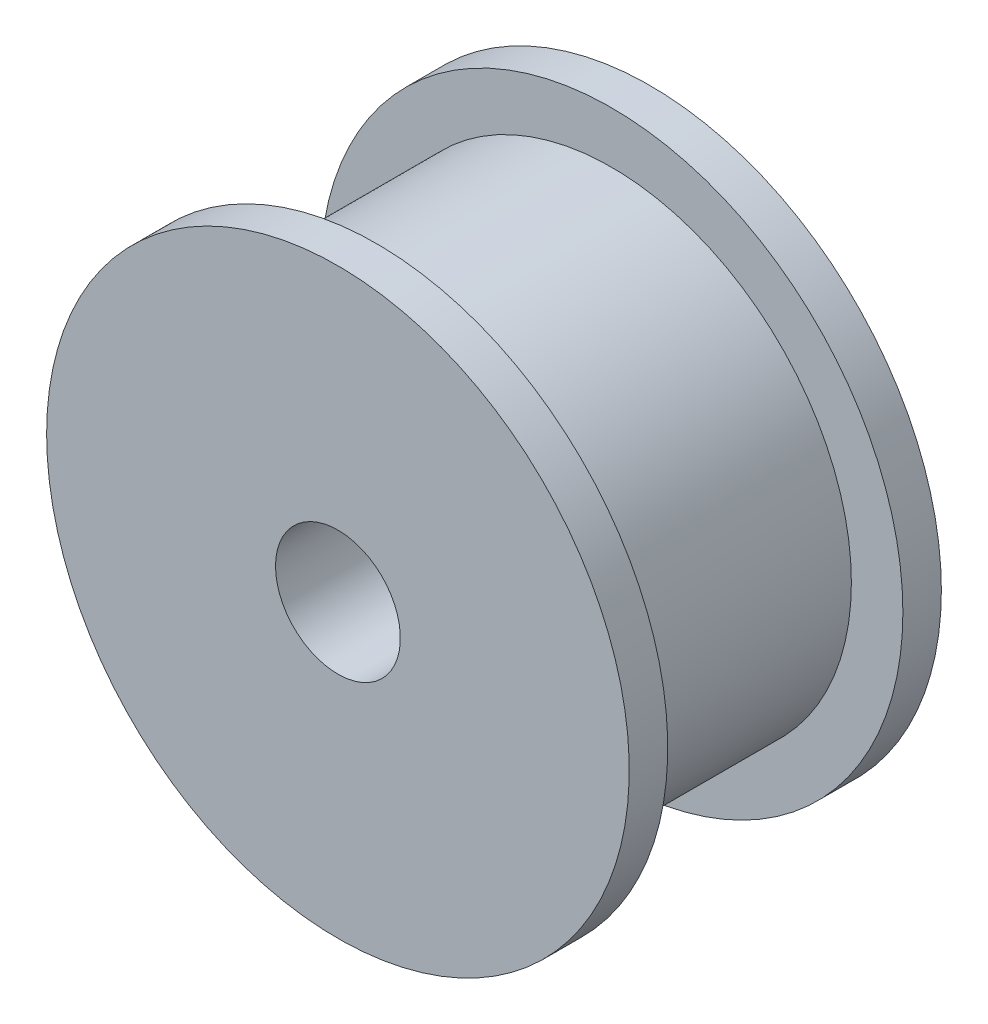
ISO-10303-21;
HEADER;
FILE_DESCRIPTION(('STEP AP214'),'2;1');
FILE_NAME('part.step','',(''),(''),'','','');
FILE_SCHEMA(('AUTOMOTIVE_DESIGN { 1 0 10303 214 1 1 1 1 }'));
ENDSEC;
DATA;
#1=APPLICATION_CONTEXT('core data for automotive mechanical design processes');
#2=APPLICATION_PROTOCOL_DEFINITION('international standard','automotive_design',2000,#1);
#3=PRODUCT_CONTEXT('',#1,'mechanical');
#4=PRODUCT('Part','Part','',(#3));
#5=PRODUCT_RELATED_PRODUCT_CATEGORY('part','',(#4));
#6=PRODUCT_DEFINITION_FORMATION('','',#4);
#7=PRODUCT_DEFINITION_CONTEXT('part definition',#1,'design');
#8=PRODUCT_DEFINITION('design','',#6,#7);
#9=PRODUCT_DEFINITION_SHAPE('','',#8);
#10=(LENGTH_UNIT() NAMED_UNIT(*) SI_UNIT(.MILLI.,.METRE.));
#11=(NAMED_UNIT(*) PLANE_ANGLE_UNIT() SI_UNIT($,.RADIAN.));
#12=(NAMED_UNIT(*) SI_UNIT($,.STERADIAN.) SOLID_ANGLE_UNIT());
#13=UNCERTAINTY_MEASURE_WITH_UNIT(LENGTH_MEASURE(1.E-05),#10,'distance_accuracy_value','');
#14=(GEOMETRIC_REPRESENTATION_CONTEXT(3) GLOBAL_UNCERTAINTY_ASSIGNED_CONTEXT((#13)) GLOBAL_UNIT_ASSIGNED_CONTEXT((#10,
#11,#12)) REPRESENTATION_CONTEXT('',''));
#15=CARTESIAN_POINT('',(0.,0.,0.));
#16=DIRECTION('',(0.,0.,1.));
#17=DIRECTION('',(1.,0.,0.));
#18=AXIS2_PLACEMENT_3D('',#15,#16,#17);
#19=CARTESIAN_POINT('',(0.,14.81019722829,-11.27));
#20=DIRECTION('',(0.,0.,1.));
#21=DIRECTION('',(1.,0.,0.));
#22=AXIS2_PLACEMENT_3D('',#19,#20,#21);
#23=PLANE('',#22);
#24=CARTESIAN_POINT('',(-8.,0.,-11.27));
#25=DIRECTION('',(0.,0.,-1.));
#26=DIRECTION('',(-1.,0.,0.));
#27=AXIS2_PLACEMENT_3D('',#24,#25,#26);
#28=CIRCLE('',#27,1.24999999999999);
#29=CARTESIAN_POINT('',(-9.24999999999999,0.,-11.27));
#30=VERTEX_POINT('',#29);
#31=EDGE_CURVE('E87',#30,#30,#28,.T.);
#32=ORIENTED_EDGE('',*,*,#31,.F.);
#33=EDGE_LOOP('',(#32));
#34=FACE_BOUND('',#33,.T.);
#35=CARTESIAN_POINT('',(0.,-8.,-11.27));
#36=DIRECTION('',(0.,0.,-1.));
#37=DIRECTION('',(-1.,0.,0.));
#38=AXIS2_PLACEMENT_3D('',#35,#36,#37);
#39=CIRCLE('',#38,1.24999999999999);
#40=CARTESIAN_POINT('',(-1.24999999999999,-8.,-11.27));
#41=VERTEX_POINT('',#40);
#42=EDGE_CURVE('E105',#41,#41,#39,.T.);
#43=ORIENTED_EDGE('',*,*,#42,.F.);
#44=EDGE_LOOP('',(#43));
#45=FACE_BOUND('',#44,.T.);
#46=CARTESIAN_POINT('',(8.,0.,-11.27));
#47=DIRECTION('',(0.,0.,-1.));
#48=DIRECTION('',(-1.,0.,0.));
#49=AXIS2_PLACEMENT_3D('',#46,#47,#48);
#50=CIRCLE('',#49,1.24999999999999);
#51=CARTESIAN_POINT('',(6.75000000000001,0.,-11.27));
#52=VERTEX_POINT('',#51);
#53=EDGE_CURVE('E99',#52,#52,#50,.T.);
#54=ORIENTED_EDGE('',*,*,#53,.F.);
#55=EDGE_LOOP('',(#54));
#56=FACE_BOUND('',#55,.T.);
#57=CARTESIAN_POINT('',(0.,8.,-11.27));
#58=DIRECTION('',(0.,0.,-1.));
#59=DIRECTION('',(-1.,0.,0.));
#60=AXIS2_PLACEMENT_3D('',#57,#58,#59);
#61=CIRCLE('',#60,1.24999999999999);
#62=CARTESIAN_POINT('',(-1.24999999999996,8.,-11.27));
#63=VERTEX_POINT('',#62);
#64=EDGE_CURVE('E86',#63,#63,#61,.T.);
#65=ORIENTED_EDGE('',*,*,#64,.F.);
#66=EDGE_LOOP('',(#65));
#67=FACE_BOUND('',#66,.T.);
#68=CARTESIAN_POINT('',(0.,0.,-11.27));
#69=DIRECTION('',(0.,0.,1.));
#70=DIRECTION('',(1.,0.,0.));
#71=AXIS2_PLACEMENT_3D('',#68,#69,#70);
#72=CIRCLE('',#71,5.35000000000001);
#73=CARTESIAN_POINT('',(5.35000000000001,0.,-11.27));
#74=VERTEX_POINT('',#73);
#75=EDGE_CURVE('E117',#74,#74,#72,.T.);
#76=ORIENTED_EDGE('',*,*,#75,.T.);
#77=EDGE_LOOP('',(#76));
#78=FACE_BOUND('',#77,.T.);
#79=CARTESIAN_POINT('',(0.,0.,-11.27));
#80=DIRECTION('',(0.,0.,1.));
#81=DIRECTION('',(1.,0.,0.));
#82=AXIS2_PLACEMENT_3D('',#79,#80,#81);
#83=CIRCLE('',#82,14.);
#84=CARTESIAN_POINT('',(14.,0.,-11.27));
#85=VERTEX_POINT('',#84);
#86=EDGE_CURVE('E199',#85,#85,#83,.T.);
#87=ORIENTED_EDGE('',*,*,#86,.F.);
#88=EDGE_LOOP('',(#87));
#89=FACE_BOUND('',#88,.T.);
#90=ADVANCED_FACE('F54',(#34,#45,#56,#67,#78,#89),#23,.F.);
#91=CARTESIAN_POINT('',(0.,14.81019722829,3.73));
#92=DIRECTION('',(0.,0.,-1.));
#93=DIRECTION('',(-1.,0.,0.));
#94=AXIS2_PLACEMENT_3D('',#91,#92,#93);
#95=PLANE('',#94);
#96=CARTESIAN_POINT('',(0.,0.,3.73));
#97=DIRECTION('',(0.,0.,-1.));
#98=DIRECTION('',(-1.,0.,0.));
#99=AXIS2_PLACEMENT_3D('',#96,#97,#98);
#100=CIRCLE('',#99,3.);
#101=CARTESIAN_POINT('',(-3.,0.,3.73));
#102=VERTEX_POINT('',#101);
#103=EDGE_CURVE('E201',#102,#102,#100,.F.);
#104=ORIENTED_EDGE('',*,*,#103,.F.);
#105=EDGE_LOOP('',(#104));
#106=FACE_BOUND('',#105,.T.);
#107=CARTESIAN_POINT('',(0.,0.,3.73));
#108=DIRECTION('',(0.,0.,-1.));
#109=DIRECTION('',(-1.,0.,0.));
#110=AXIS2_PLACEMENT_3D('',#107,#108,#109);
#111=CIRCLE('',#110,14.);
#112=CARTESIAN_POINT('',(-14.,0.,3.73));
#113=VERTEX_POINT('',#112);
#114=EDGE_CURVE('E202',#113,#113,#111,.T.);
#115=ORIENTED_EDGE('',*,*,#114,.F.);
#116=EDGE_LOOP('',(#115));
#117=FACE_BOUND('',#116,.T.);
#118=ADVANCED_FACE('F141',(#106,#117),#95,.F.);
#119=CARTESIAN_POINT('',(0.,0.,-11.2700000000059));
#120=DIRECTION('',(0.,0.,1.));
#121=DIRECTION('',(1.,0.,0.));
#122=AXIS2_PLACEMENT_3D('',#119,#120,#121);
#123=CYLINDRICAL_SURFACE('',#122,3.);
#124=ORIENTED_EDGE('',*,*,#103,.T.);
#125=EDGE_LOOP('',(#124));
#126=FACE_BOUND('',#125,.T.);
#127=CARTESIAN_POINT('',(0.,0.,-9.27));
#128=DIRECTION('',(0.,0.,-1.));
#129=DIRECTION('',(-1.,0.,0.));
#130=AXIS2_PLACEMENT_3D('',#127,#128,#129);
#131=CIRCLE('',#130,3.);
#132=CARTESIAN_POINT('',(-3.,0.,-9.27));
#133=VERTEX_POINT('',#132);
#134=EDGE_CURVE('E93',#133,#133,#131,.F.);
#135=ORIENTED_EDGE('',*,*,#134,.F.);
#136=EDGE_LOOP('',(#135));
#137=FACE_BOUND('',#136,.T.);
#138=ADVANCED_FACE('F147',(#126,#137),#123,.F.);
#139=CARTESIAN_POINT('',(0.,-8.,-2.77000000000001));
#140=DIRECTION('',(0.,0.,-1.));
#141=DIRECTION('',(-1.,0.,0.));
#142=AXIS2_PLACEMENT_3D('',#139,#140,#141);
#143=CONICAL_SURFACE('',#142,1.24999999999999,1.02974425867665);
#144=CARTESIAN_POINT('',(0.,-8.,-2.01892422621556));
#145=VERTEX_POINT('',#144);
#146=VERTEX_LOOP('',#145);
#147=FACE_BOUND('',#146,.T.);
#148=CARTESIAN_POINT('',(0.,-8.,-2.77000000000001));
#149=DIRECTION('',(0.,0.,-1.));
#150=DIRECTION('',(-1.,0.,0.));
#151=AXIS2_PLACEMENT_3D('',#148,#149,#150);
#152=CIRCLE('',#151,1.24999999999999);
#153=CARTESIAN_POINT('',(-1.24999999999999,-8.,-2.77000000000001));
#154=VERTEX_POINT('',#153);
#155=EDGE_CURVE('E108',#154,#154,#152,.T.);
#156=ORIENTED_EDGE('',*,*,#155,.T.);
#157=EDGE_LOOP('',(#156));
#158=FACE_BOUND('',#157,.T.);
#159=ADVANCED_FACE('F154',(#147,#158),#143,.F.);
#160=CARTESIAN_POINT('',(0.,-8.,-11.27));
#161=DIRECTION('',(0.,0.,-1.));
#162=DIRECTION('',(-1.,0.,0.));
#163=AXIS2_PLACEMENT_3D('',#160,#161,#162);
#164=CYLINDRICAL_SURFACE('',#163,1.24999999999999);
#165=ORIENTED_EDGE('',*,*,#155,.F.);
#166=EDGE_LOOP('',(#165));
#167=FACE_BOUND('',#166,.T.);
#168=ORIENTED_EDGE('',*,*,#42,.T.);
#169=EDGE_LOOP('',(#168));
#170=FACE_BOUND('',#169,.T.);
#171=ADVANCED_FACE('F158',(#167,#170),#164,.F.);
#172=CARTESIAN_POINT('',(8.,0.,-2.77000000000001));
#173=DIRECTION('',(0.,0.,-1.));
#174=DIRECTION('',(-1.,0.,0.));
#175=AXIS2_PLACEMENT_3D('',#172,#173,#174);
#176=CONICAL_SURFACE('',#175,1.24999999999999,1.02974425867665);
#177=CARTESIAN_POINT('',(8.,0.,-2.01892422621556));
#178=VERTEX_POINT('',#177);
#179=VERTEX_LOOP('',#178);
#180=FACE_BOUND('',#179,.T.);
#181=CARTESIAN_POINT('',(8.,0.,-2.77000000000001));
#182=DIRECTION('',(0.,0.,-1.));
#183=DIRECTION('',(-1.,0.,0.));
#184=AXIS2_PLACEMENT_3D('',#181,#182,#183);
#185=CIRCLE('',#184,1.24999999999999);
#186=CARTESIAN_POINT('',(6.75000000000001,0.,-2.77000000000001));
#187=VERTEX_POINT('',#186);
#188=EDGE_CURVE('E102',#187,#187,#185,.T.);
#189=ORIENTED_EDGE('',*,*,#188,.T.);
#190=EDGE_LOOP('',(#189));
#191=FACE_BOUND('',#190,.T.);
#192=ADVANCED_FACE('F161',(#180,#191),#176,.F.);
#193=CARTESIAN_POINT('',(8.,0.,-11.27));
#194=DIRECTION('',(0.,0.,-1.));
#195=DIRECTION('',(-1.,0.,0.));
#196=AXIS2_PLACEMENT_3D('',#193,#194,#195);
#197=CYLINDRICAL_SURFACE('',#196,1.24999999999999);
#198=ORIENTED_EDGE('',*,*,#188,.F.);
#199=EDGE_LOOP('',(#198));
#200=FACE_BOUND('',#199,.T.);
#201=ORIENTED_EDGE('',*,*,#53,.T.);
#202=EDGE_LOOP('',(#201));
#203=FACE_BOUND('',#202,.T.);
#204=ADVANCED_FACE('F165',(#200,#203),#197,.F.);
#205=CARTESIAN_POINT('',(0.,8.,-2.77000000000001));
#206=DIRECTION('',(0.,0.,-1.));
#207=DIRECTION('',(-1.,0.,0.));
#208=AXIS2_PLACEMENT_3D('',#205,#206,#207);
#209=CONICAL_SURFACE('',#208,1.24999999999999,1.02974425867665);
#210=CARTESIAN_POINT('',(0.,8.,-2.01892422621556));
#211=VERTEX_POINT('',#210);
#212=VERTEX_LOOP('',#211);
#213=FACE_BOUND('',#212,.T.);
#214=CARTESIAN_POINT('',(0.,8.,-2.77000000000001));
#215=DIRECTION('',(0.,0.,-1.));
#216=DIRECTION('',(-1.,0.,0.));
#217=AXIS2_PLACEMENT_3D('',#214,#215,#216);
#218=CIRCLE('',#217,1.24999999999999);
#219=CARTESIAN_POINT('',(-1.24999999999996,8.,-2.77000000000001));
#220=VERTEX_POINT('',#219);
#221=EDGE_CURVE('E90',#220,#220,#218,.T.);
#222=ORIENTED_EDGE('',*,*,#221,.T.);
#223=EDGE_LOOP('',(#222));
#224=FACE_BOUND('',#223,.T.);
#225=ADVANCED_FACE('F168',(#213,#224),#209,.F.);
#226=CARTESIAN_POINT('',(0.,8.,-11.27));
#227=DIRECTION('',(0.,0.,-1.));
#228=DIRECTION('',(-1.,0.,0.));
#229=AXIS2_PLACEMENT_3D('',#226,#227,#228);
#230=CYLINDRICAL_SURFACE('',#229,1.24999999999999);
#231=ORIENTED_EDGE('',*,*,#221,.F.);
#232=EDGE_LOOP('',(#231));
#233=FACE_BOUND('',#232,.T.);
#234=ORIENTED_EDGE('',*,*,#64,.T.);
#235=EDGE_LOOP('',(#234));
#236=FACE_BOUND('',#235,.T.);
#237=ADVANCED_FACE('F80',(#233,#236),#230,.F.);
#238=CARTESIAN_POINT('',(-8.,0.,-2.77000000000001));
#239=DIRECTION('',(0.,0.,-1.));
#240=DIRECTION('',(-1.,0.,0.));
#241=AXIS2_PLACEMENT_3D('',#238,#239,#240);
#242=CONICAL_SURFACE('',#241,1.24999999999999,1.02974425867665);
#243=CARTESIAN_POINT('',(-8.,0.,-2.01892422621556));
#244=VERTEX_POINT('',#243);
#245=VERTEX_LOOP('',#244);
#246=FACE_BOUND('',#245,.T.);
#247=CARTESIAN_POINT('',(-8.,0.,-2.77000000000001));
#248=DIRECTION('',(0.,0.,-1.));
#249=DIRECTION('',(-1.,0.,0.));
#250=AXIS2_PLACEMENT_3D('',#247,#248,#249);
#251=CIRCLE('',#250,1.24999999999999);
#252=CARTESIAN_POINT('',(-9.24999999999999,0.,-2.77000000000001));
#253=VERTEX_POINT('',#252);
#254=EDGE_CURVE('E84',#253,#253,#251,.T.);
#255=ORIENTED_EDGE('',*,*,#254,.T.);
#256=EDGE_LOOP('',(#255));
#257=FACE_BOUND('',#256,.T.);
#258=ADVANCED_FACE('F76',(#246,#257),#242,.F.);
#259=CARTESIAN_POINT('',(-8.,0.,-11.27));
#260=DIRECTION('',(0.,0.,-1.));
#261=DIRECTION('',(-1.,0.,0.));
#262=AXIS2_PLACEMENT_3D('',#259,#260,#261);
#263=CYLINDRICAL_SURFACE('',#262,1.24999999999999);
#264=ORIENTED_EDGE('',*,*,#254,.F.);
#265=EDGE_LOOP('',(#264));
#266=FACE_BOUND('',#265,.T.);
#267=ORIENTED_EDGE('',*,*,#31,.T.);
#268=EDGE_LOOP('',(#267));
#269=FACE_BOUND('',#268,.T.);
#270=ADVANCED_FACE('F79',(#266,#269),#263,.F.);
#271=CARTESIAN_POINT('',(0.,0.,-9.27));
#272=DIRECTION('',(0.,0.,-1.));
#273=DIRECTION('',(-1.,0.,0.));
#274=AXIS2_PLACEMENT_3D('',#271,#272,#273);
#275=PLANE('',#274);
#276=CARTESIAN_POINT('',(0.,0.,-9.27));
#277=DIRECTION('',(0.,0.,-1.));
#278=DIRECTION('',(-1.,0.,0.));
#279=AXIS2_PLACEMENT_3D('',#276,#277,#278);
#280=CIRCLE('',#279,5.05);
#281=CARTESIAN_POINT('',(-5.05,0.,-9.27));
#282=VERTEX_POINT('',#281);
#283=EDGE_CURVE('E114',#282,#282,#280,.T.);
#284=ORIENTED_EDGE('',*,*,#283,.T.);
#285=EDGE_LOOP('',(#284));
#286=FACE_BOUND('',#285,.T.);
#287=ORIENTED_EDGE('',*,*,#134,.T.);
#288=EDGE_LOOP('',(#287));
#289=FACE_BOUND('',#288,.T.);
#290=ADVANCED_FACE('F178',(#286,#289),#275,.T.);
#291=CARTESIAN_POINT('',(0.,0.,-9.27));
#292=DIRECTION('',(0.,0.,-1.));
#293=DIRECTION('',(-1.,0.,0.));
#294=AXIS2_PLACEMENT_3D('',#291,#292,#293);
#295=CYLINDRICAL_SURFACE('',#294,5.05);
#296=CARTESIAN_POINT('',(0.,0.,-10.97));
#297=DIRECTION('',(0.,0.,1.));
#298=DIRECTION('',(1.,0.,0.));
#299=AXIS2_PLACEMENT_3D('',#296,#297,#298);
#300=CIRCLE('',#299,5.05);
#301=CARTESIAN_POINT('',(5.05,0.,-10.97));
#302=VERTEX_POINT('',#301);
#303=EDGE_CURVE('E111',#302,#302,#300,.F.);
#304=ORIENTED_EDGE('',*,*,#303,.T.);
#305=EDGE_LOOP('',(#304));
#306=FACE_BOUND('',#305,.T.);
#307=ORIENTED_EDGE('',*,*,#283,.F.);
#308=EDGE_LOOP('',(#307));
#309=FACE_BOUND('',#308,.T.);
#310=ADVANCED_FACE('F179',(#306,#309),#295,.F.);
#311=CARTESIAN_POINT('',(0.,0.,-10.97));
#312=DIRECTION('',(0.,0.,-1.));
#313=DIRECTION('',(-1.,0.,0.));
#314=AXIS2_PLACEMENT_3D('',#311,#312,#313);
#315=CONICAL_SURFACE('',#314,5.05,0.785398163397435);
#316=ORIENTED_EDGE('',*,*,#75,.F.);
#317=EDGE_LOOP('',(#316));
#318=FACE_BOUND('',#317,.T.);
#319=ORIENTED_EDGE('',*,*,#303,.F.);
#320=EDGE_LOOP('',(#319));
#321=FACE_BOUND('',#320,.T.);
#322=ADVANCED_FACE('F56',(#318,#321),#315,.F.);
#323=CARTESIAN_POINT('',(0.,0.,-11.5202377215361));
#324=DIRECTION('',(0.,0.,1.));
#325=DIRECTION('',(1.,0.,0.));
#326=AXIS2_PLACEMENT_3D('',#323,#324,#325);
#327=CYLINDRICAL_SURFACE('',#326,14.);
#328=CARTESIAN_POINT('',(0.,0.,1.87999999999933));
#329=DIRECTION('',(0.,0.,-1.));
#330=DIRECTION('',(-1.,0.,0.));
#331=AXIS2_PLACEMENT_3D('',#328,#329,#330);
#332=CIRCLE('',#331,14.);
#333=CARTESIAN_POINT('',(-14.,0.,1.87999999999933));
#334=VERTEX_POINT('',#333);
#335=EDGE_CURVE('E58',#334,#334,#332,.T.);
#336=ORIENTED_EDGE('',*,*,#335,.F.);
#337=EDGE_LOOP('',(#336));
#338=FACE_BOUND('',#337,.T.);
#339=ORIENTED_EDGE('',*,*,#114,.T.);
#340=EDGE_LOOP('',(#339));
#341=FACE_BOUND('',#340,.T.);
#342=ADVANCED_FACE('F187',(#338,#341),#327,.T.);
#343=CARTESIAN_POINT('',(0.,0.,-9.42000000000067));
#344=DIRECTION('',(0.,0.,1.));
#345=DIRECTION('',(1.,0.,0.));
#346=AXIS2_PLACEMENT_3D('',#343,#344,#345);
#347=CIRCLE('',#346,14.);
#348=CARTESIAN_POINT('',(14.,0.,-9.42000000000067));
#349=VERTEX_POINT('',#348);
#350=EDGE_CURVE('E196',#349,#349,#347,.T.);
#351=ORIENTED_EDGE('',*,*,#350,.F.);
#352=EDGE_LOOP('',(#351));
#353=FACE_BOUND('',#352,.T.);
#354=ORIENTED_EDGE('',*,*,#86,.T.);
#355=EDGE_LOOP('',(#354));
#356=FACE_BOUND('',#355,.T.);
#357=ADVANCED_FACE('F136',(#353,#356),#327,.T.);
#358=CARTESIAN_POINT('',(-14.8499999999988,0.,-9.42000000000067));
#359=DIRECTION('',(0.,0.,1.));
#360=DIRECTION('',(1.,0.,0.));
#361=AXIS2_PLACEMENT_3D('',#358,#359,#360);
#362=PLANE('',#361);
#363=CARTESIAN_POINT('',(0.,0.,-9.42000000000067));
#364=DIRECTION('',(0.,0.,1.));
#365=DIRECTION('',(1.,0.,0.));
#366=AXIS2_PLACEMENT_3D('',#363,#364,#365);
#367=CIRCLE('',#366,11.525);
#368=CARTESIAN_POINT('',(11.525,0.,-9.42000000000067));
#369=VERTEX_POINT('',#368);
#370=EDGE_CURVE('E63',#369,#369,#367,.F.);
#371=ORIENTED_EDGE('',*,*,#370,.T.);
#372=EDGE_LOOP('',(#371));
#373=FACE_BOUND('',#372,.T.);
#374=ORIENTED_EDGE('',*,*,#350,.T.);
#375=EDGE_LOOP('',(#374));
#376=FACE_BOUND('',#375,.T.);
#377=ADVANCED_FACE('F123',(#373,#376),#362,.T.);
#378=CARTESIAN_POINT('',(0.,0.,0.));
#379=DIRECTION('',(0.,0.,1.));
#380=DIRECTION('',(1.,0.,0.));
#381=AXIS2_PLACEMENT_3D('',#378,#379,#380);
#382=CYLINDRICAL_SURFACE('',#381,11.525);
#383=CARTESIAN_POINT('',(0.,0.,1.87999999999933));
#384=DIRECTION('',(0.,0.,-1.));
#385=DIRECTION('',(-1.,0.,0.));
#386=AXIS2_PLACEMENT_3D('',#383,#384,#385);
#387=CIRCLE('',#386,11.525);
#388=CARTESIAN_POINT('',(-11.525,0.,1.87999999999933));
#389=VERTEX_POINT('',#388);
#390=EDGE_CURVE('E13',#389,#389,#387,.F.);
#391=ORIENTED_EDGE('',*,*,#390,.F.);
#392=EDGE_LOOP('',(#391));
#393=FACE_BOUND('',#392,.T.);
#394=ORIENTED_EDGE('',*,*,#370,.F.);
#395=EDGE_LOOP('',(#394));
#396=FACE_BOUND('',#395,.T.);
#397=ADVANCED_FACE('F126',(#393,#396),#382,.T.);
#398=CARTESIAN_POINT('',(-14.8499999999988,0.,1.87999999999933));
#399=DIRECTION('',(0.,0.,-1.));
#400=DIRECTION('',(-1.,0.,0.));
#401=AXIS2_PLACEMENT_3D('',#398,#399,#400);
#402=PLANE('',#401);
#403=ORIENTED_EDGE('',*,*,#390,.T.);
#404=EDGE_LOOP('',(#403));
#405=FACE_BOUND('',#404,.T.);
#406=ORIENTED_EDGE('',*,*,#335,.T.);
#407=EDGE_LOOP('',(#406));
#408=FACE_BOUND('',#407,.T.);
#409=ADVANCED_FACE('F128',(#405,#408),#402,.T.);
#410=CLOSED_SHELL('',(#90,#118,#138,#159,#171,#192,#204,#225,#237,#258,#270,#290,#310,#322,#342,
#357,#377,#397,#409));
#411=MANIFOLD_SOLID_BREP('B2',#410);
#412=ADVANCED_BREP_SHAPE_REPRESENTATION('',(#18,#411),#14);
#413=SHAPE_DEFINITION_REPRESENTATION(#9,#412);
ENDSEC;
END-ISO-10303-21;
